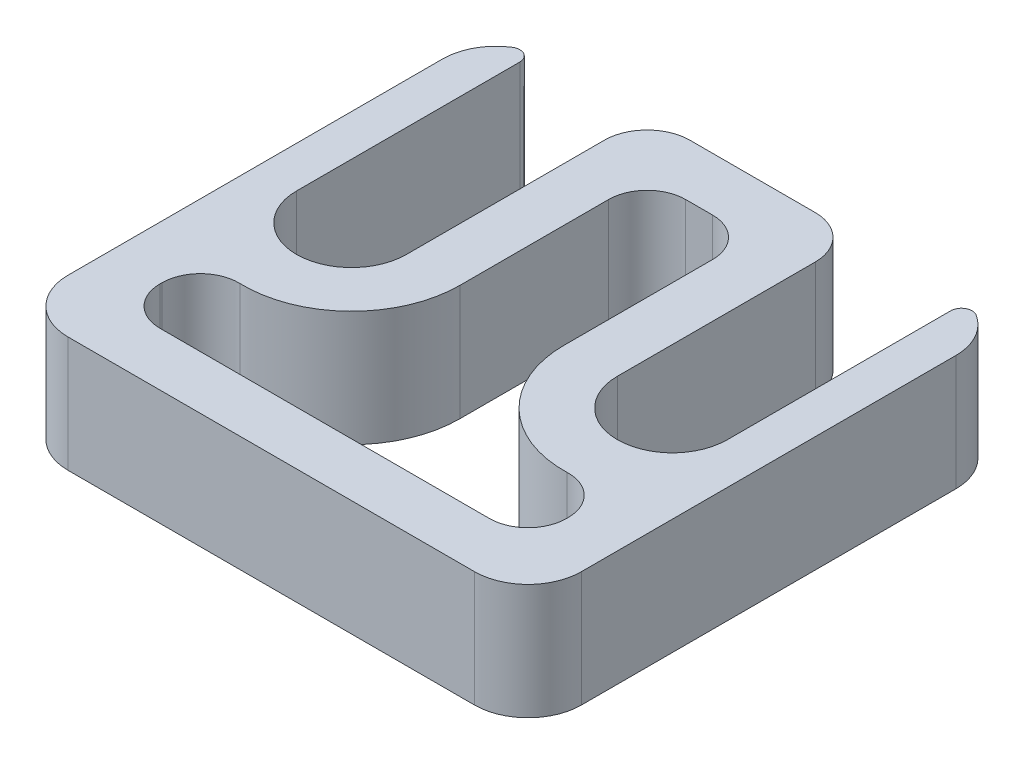
ISO-10303-21;
HEADER;
FILE_DESCRIPTION(('STEP AP214'),'2;1');
FILE_NAME('part.step','',(''),(''),'','','');
FILE_SCHEMA(('AUTOMOTIVE_DESIGN { 1 0 10303 214 1 1 1 1 }'));
ENDSEC;
DATA;
#1=APPLICATION_CONTEXT('core data for automotive mechanical design processes');
#2=APPLICATION_PROTOCOL_DEFINITION('international standard','automotive_design',2000,#1);
#3=PRODUCT_CONTEXT('',#1,'mechanical');
#4=PRODUCT('Part','Part','',(#3));
#5=PRODUCT_RELATED_PRODUCT_CATEGORY('part','',(#4));
#6=PRODUCT_DEFINITION_FORMATION('','',#4);
#7=PRODUCT_DEFINITION_CONTEXT('part definition',#1,'design');
#8=PRODUCT_DEFINITION('design','',#6,#7);
#9=PRODUCT_DEFINITION_SHAPE('','',#8);
#10=(LENGTH_UNIT() NAMED_UNIT(*) SI_UNIT(.MILLI.,.METRE.));
#11=(NAMED_UNIT(*) PLANE_ANGLE_UNIT() SI_UNIT($,.RADIAN.));
#12=(NAMED_UNIT(*) SI_UNIT($,.STERADIAN.) SOLID_ANGLE_UNIT());
#13=UNCERTAINTY_MEASURE_WITH_UNIT(LENGTH_MEASURE(1.E-05),#10,'distance_accuracy_value','');
#14=(GEOMETRIC_REPRESENTATION_CONTEXT(3) GLOBAL_UNCERTAINTY_ASSIGNED_CONTEXT((#13)) GLOBAL_UNIT_ASSIGNED_CONTEXT((#10,
#11,#12)) REPRESENTATION_CONTEXT('',''));
#15=CARTESIAN_POINT('',(0.,0.,0.));
#16=DIRECTION('',(0.,0.,1.));
#17=DIRECTION('',(1.,0.,0.));
#18=AXIS2_PLACEMENT_3D('',#15,#16,#17);
#19=CARTESIAN_POINT('',(3.17499999999999,552.958,280.4795));
#20=DIRECTION('',(0.,-1.,0.));
#21=DIRECTION('',(0.,0.,-1.));
#22=AXIS2_PLACEMENT_3D('',#19,#20,#21);
#23=PLANE('',#22);
#24=CARTESIAN_POINT('',(27.305,552.958,280.4795));
#25=DIRECTION('',(0.,-1.,0.));
#26=DIRECTION('',(0.,0.,-1.));
#27=AXIS2_PLACEMENT_3D('',#24,#25,#26);
#28=CIRCLE('',#27,3.17500000000001);
#29=CARTESIAN_POINT('',(29.003625,552.958,277.797094715675));
#30=VERTEX_POINT('',#29);
#31=CARTESIAN_POINT('',(30.48,552.958,280.4795));
#32=VERTEX_POINT('',#31);
#33=EDGE_CURVE('E307',#30,#32,#28,.T.);
#34=ORIENTED_EDGE('',*,*,#33,.F.);
#35=CARTESIAN_POINT('',(28.6639,552.958,278.33357577254));
#36=DIRECTION('',(0.,-1.,0.));
#37=DIRECTION('',(0.,0.,-1.));
#38=AXIS2_PLACEMENT_3D('',#35,#36,#37);
#39=CIRCLE('',#38,0.635);
#40=CARTESIAN_POINT('',(28.0289,552.958,278.33357577254));
#41=VERTEX_POINT('',#40);
#42=EDGE_CURVE('E413',#30,#41,#39,.F.);
#43=ORIENTED_EDGE('',*,*,#42,.T.);
#44=DIRECTION('',(0.,0.,-1.));
#45=VECTOR('',#44,1.);
#46=CARTESIAN_POINT('',(28.0289,552.958,291.592));
#47=LINE('',#46,#45);
#48=CARTESIAN_POINT('',(28.0289,552.958,291.592));
#49=VERTEX_POINT('',#48);
#50=EDGE_CURVE('E304',#49,#41,#47,.T.);
#51=ORIENTED_EDGE('',*,*,#50,.F.);
#52=CARTESIAN_POINT('',(24.765,552.958,291.592));
#53=DIRECTION('',(0.,1.,0.));
#54=DIRECTION('',(0.,0.,-1.));
#55=AXIS2_PLACEMENT_3D('',#52,#53,#54);
#56=CIRCLE('',#55,3.26389999999999);
#57=CARTESIAN_POINT('',(21.5011,552.958,291.592));
#58=VERTEX_POINT('',#57);
#59=EDGE_CURVE('E301',#58,#49,#56,.T.);
#60=ORIENTED_EDGE('',*,*,#59,.F.);
#61=DIRECTION('',(0.,0.,1.));
#62=VECTOR('',#61,1.);
#63=CARTESIAN_POINT('',(21.5011,552.958,291.592));
#64=LINE('',#63,#62);
#65=CARTESIAN_POINT('',(21.5011,552.958,279.8445));
#66=VERTEX_POINT('',#65);
#67=EDGE_CURVE('E299',#66,#58,#64,.T.);
#68=ORIENTED_EDGE('',*,*,#67,.F.);
#69=CARTESIAN_POINT('',(18.9611,552.958,279.8445));
#70=DIRECTION('',(0.,-1.,0.));
#71=DIRECTION('',(0.,0.,-1.));
#72=AXIS2_PLACEMENT_3D('',#69,#70,#71);
#73=CIRCLE('',#72,2.54);
#74=CARTESIAN_POINT('',(18.9611,552.958,277.3045));
#75=VERTEX_POINT('',#74);
#76=EDGE_CURVE('E397',#66,#75,#73,.F.);
#77=ORIENTED_EDGE('',*,*,#76,.T.);
#78=DIRECTION('',(1.,0.,0.));
#79=VECTOR('',#78,1.);
#80=CARTESIAN_POINT('',(8.97889999999997,552.958,277.3045));
#81=LINE('',#80,#79);
#82=CARTESIAN_POINT('',(11.5189,552.958,277.3045));
#83=VERTEX_POINT('',#82);
#84=EDGE_CURVE('E296',#83,#75,#81,.T.);
#85=ORIENTED_EDGE('',*,*,#84,.F.);
#86=CARTESIAN_POINT('',(11.5189,552.958,279.8445));
#87=DIRECTION('',(0.,-1.,0.));
#88=DIRECTION('',(0.,0.,-1.));
#89=AXIS2_PLACEMENT_3D('',#86,#87,#88);
#90=CIRCLE('',#89,2.54);
#91=CARTESIAN_POINT('',(8.97889999999997,552.958,279.8445));
#92=VERTEX_POINT('',#91);
#93=EDGE_CURVE('E395',#83,#92,#90,.F.);
#94=ORIENTED_EDGE('',*,*,#93,.T.);
#95=DIRECTION('',(0.,0.,-1.));
#96=VECTOR('',#95,1.);
#97=CARTESIAN_POINT('',(8.97889999999997,552.958,291.592));
#98=LINE('',#97,#96);
#99=CARTESIAN_POINT('',(8.97889999999997,552.958,291.592));
#100=VERTEX_POINT('',#99);
#101=EDGE_CURVE('E293',#100,#92,#98,.T.);
#102=ORIENTED_EDGE('',*,*,#101,.F.);
#103=CARTESIAN_POINT('',(5.71499999999998,552.958,291.592));
#104=DIRECTION('',(0.,1.,0.));
#105=DIRECTION('',(0.,0.,-1.));
#106=AXIS2_PLACEMENT_3D('',#103,#104,#105);
#107=CIRCLE('',#106,3.26389999999999);
#108=CARTESIAN_POINT('',(2.4511,552.958,291.592));
#109=VERTEX_POINT('',#108);
#110=EDGE_CURVE('E290',#109,#100,#107,.T.);
#111=ORIENTED_EDGE('',*,*,#110,.F.);
#112=DIRECTION('',(0.,0.,1.));
#113=VECTOR('',#112,1.);
#114=CARTESIAN_POINT('',(2.4511,552.958,291.592));
#115=LINE('',#114,#113);
#116=CARTESIAN_POINT('',(2.4511,552.958,278.33357577254));
#117=VERTEX_POINT('',#116);
#118=EDGE_CURVE('E287',#117,#109,#115,.T.);
#119=ORIENTED_EDGE('',*,*,#118,.F.);
#120=CARTESIAN_POINT('',(1.8161,552.958,278.33357577254));
#121=DIRECTION('',(0.,-1.,0.));
#122=DIRECTION('',(0.,0.,-1.));
#123=AXIS2_PLACEMENT_3D('',#120,#121,#122);
#124=CIRCLE('',#123,0.635);
#125=CARTESIAN_POINT('',(1.47637500000001,552.958,277.797094715675));
#126=VERTEX_POINT('',#125);
#127=EDGE_CURVE('E411',#117,#126,#124,.F.);
#128=ORIENTED_EDGE('',*,*,#127,.T.);
#129=CARTESIAN_POINT('',(3.17499999999999,552.958,280.4795));
#130=DIRECTION('',(0.,-1.,0.));
#131=DIRECTION('',(0.,0.,-1.));
#132=AXIS2_PLACEMENT_3D('',#129,#130,#131);
#133=CIRCLE('',#132,3.17499999999999);
#134=CARTESIAN_POINT('',(0.,552.958,280.4795));
#135=VERTEX_POINT('',#134);
#136=EDGE_CURVE('E284',#135,#126,#133,.T.);
#137=ORIENTED_EDGE('',*,*,#136,.F.);
#138=DIRECTION('',(0.,0.,-1.));
#139=VECTOR('',#138,1.);
#140=CARTESIAN_POINT('',(0.,552.958,302.7045));
#141=LINE('',#140,#139);
#142=CARTESIAN_POINT('',(0.,552.958,302.7045));
#143=VERTEX_POINT('',#142);
#144=EDGE_CURVE('E321',#143,#135,#141,.T.);
#145=ORIENTED_EDGE('',*,*,#144,.F.);
#146=CARTESIAN_POINT('',(3.17499999999999,552.958,302.7045));
#147=DIRECTION('',(0.,-1.,0.));
#148=DIRECTION('',(0.,0.,-1.));
#149=AXIS2_PLACEMENT_3D('',#146,#147,#148);
#150=CIRCLE('',#149,3.17499999999998);
#151=CARTESIAN_POINT('',(3.17499999999999,552.958,305.8795));
#152=VERTEX_POINT('',#151);
#153=EDGE_CURVE('E318',#152,#143,#150,.T.);
#154=ORIENTED_EDGE('',*,*,#153,.F.);
#155=DIRECTION('',(-1.,0.,0.));
#156=VECTOR('',#155,1.);
#157=CARTESIAN_POINT('',(27.305,552.958,305.8795));
#158=LINE('',#157,#156);
#159=CARTESIAN_POINT('',(27.305,552.958,305.8795));
#160=VERTEX_POINT('',#159);
#161=EDGE_CURVE('E315',#160,#152,#158,.T.);
#162=ORIENTED_EDGE('',*,*,#161,.F.);
#163=CARTESIAN_POINT('',(27.305,552.958,302.7045));
#164=DIRECTION('',(0.,-1.,0.));
#165=DIRECTION('',(0.,0.,-1.));
#166=AXIS2_PLACEMENT_3D('',#163,#164,#165);
#167=CIRCLE('',#166,3.17499999999998);
#168=CARTESIAN_POINT('',(30.48,552.958,302.7045));
#169=VERTEX_POINT('',#168);
#170=EDGE_CURVE('E312',#169,#160,#167,.T.);
#171=ORIENTED_EDGE('',*,*,#170,.F.);
#172=DIRECTION('',(0.,0.,1.));
#173=VECTOR('',#172,1.);
#174=CARTESIAN_POINT('',(30.48,552.958,280.4795));
#175=LINE('',#174,#173);
#176=EDGE_CURVE('E309',#32,#169,#175,.T.);
#177=ORIENTED_EDGE('',*,*,#176,.F.);
#178=EDGE_LOOP('',(#34,#43,#51,#60,#68,#77,#85,#94,#102,#111,#119,#128,#137,#145,#154,#162,#171,#177));
#179=FACE_BOUND('',#178,.T.);
#180=CARTESIAN_POINT('',(24.765,552.958,291.592));
#181=DIRECTION('',(0.,-1.,0.));
#182=DIRECTION('',(0.,0.,-1.));
#183=AXIS2_PLACEMENT_3D('',#180,#181,#182);
#184=CIRCLE('',#183,6.4389);
#185=CARTESIAN_POINT('',(24.9524497816594,552.958,298.028170894978));
#186=VERTEX_POINT('',#185);
#187=CARTESIAN_POINT('',(18.3261,552.958,291.592));
#188=VERTEX_POINT('',#187);
#189=EDGE_CURVE('E617',#186,#188,#184,.T.);
#190=ORIENTED_EDGE('',*,*,#189,.F.);
#191=CARTESIAN_POINT('',(25.019,552.958,300.313201981952));
#192=DIRECTION('',(0.,-1.,0.));
#193=DIRECTION('',(0.,0.,-1.));
#194=AXIS2_PLACEMENT_3D('',#191,#192,#193);
#195=CIRCLE('',#194,2.286);
#196=CARTESIAN_POINT('',(27.305,552.958,300.313201981952));
#197=VERTEX_POINT('',#196);
#198=EDGE_CURVE('E474',#186,#197,#195,.T.);
#199=ORIENTED_EDGE('',*,*,#198,.T.);
#200=DIRECTION('',(0.,0.,1.));
#201=VECTOR('',#200,1.);
#202=CARTESIAN_POINT('',(27.305,552.958,0.));
#203=LINE('',#202,#201);
#204=CARTESIAN_POINT('',(27.305,552.958,300.4185));
#205=VERTEX_POINT('',#204);
#206=EDGE_CURVE('E612',#197,#205,#203,.T.);
#207=ORIENTED_EDGE('',*,*,#206,.T.);
#208=CARTESIAN_POINT('',(25.019,552.958,300.4185));
#209=DIRECTION('',(0.,-1.,0.));
#210=DIRECTION('',(0.,0.,-1.));
#211=AXIS2_PLACEMENT_3D('',#208,#209,#210);
#212=CIRCLE('',#211,2.286);
#213=CARTESIAN_POINT('',(25.019,552.958,302.7045));
#214=VERTEX_POINT('',#213);
#215=EDGE_CURVE('E478',#205,#214,#212,.T.);
#216=ORIENTED_EDGE('',*,*,#215,.T.);
#217=DIRECTION('',(-1.,0.,0.));
#218=VECTOR('',#217,1.);
#219=CARTESIAN_POINT('',(0.,552.958,302.7045));
#220=LINE('',#219,#218);
#221=CARTESIAN_POINT('',(5.46099999999999,552.958,302.7045));
#222=VERTEX_POINT('',#221);
#223=EDGE_CURVE('E273',#214,#222,#220,.T.);
#224=ORIENTED_EDGE('',*,*,#223,.T.);
#225=CARTESIAN_POINT('',(5.46099999999999,552.958,300.4185));
#226=DIRECTION('',(0.,-1.,0.));
#227=DIRECTION('',(0.,0.,-1.));
#228=AXIS2_PLACEMENT_3D('',#225,#226,#227);
#229=CIRCLE('',#228,2.286);
#230=CARTESIAN_POINT('',(3.17499999999999,552.958,300.4185));
#231=VERTEX_POINT('',#230);
#232=EDGE_CURVE('E482',#222,#231,#229,.T.);
#233=ORIENTED_EDGE('',*,*,#232,.T.);
#234=DIRECTION('',(0.,0.,-1.));
#235=VECTOR('',#234,1.);
#236=CARTESIAN_POINT('',(3.17499999999999,552.958,0.));
#237=LINE('',#236,#235);
#238=CARTESIAN_POINT('',(3.17499999999999,552.958,300.313201981952));
#239=VERTEX_POINT('',#238);
#240=EDGE_CURVE('E271',#231,#239,#237,.T.);
#241=ORIENTED_EDGE('',*,*,#240,.T.);
#242=CARTESIAN_POINT('',(5.46099999999999,552.958,300.313201981952));
#243=DIRECTION('',(0.,-1.,0.));
#244=DIRECTION('',(0.,0.,-1.));
#245=AXIS2_PLACEMENT_3D('',#242,#243,#244);
#246=CIRCLE('',#245,2.286);
#247=CARTESIAN_POINT('',(5.5275502183406,552.958,298.028170894978));
#248=VERTEX_POINT('',#247);
#249=EDGE_CURVE('E270',#239,#248,#246,.T.);
#250=ORIENTED_EDGE('',*,*,#249,.T.);
#251=CARTESIAN_POINT('',(5.71499999999998,552.958,291.592));
#252=DIRECTION('',(0.,-1.,0.));
#253=DIRECTION('',(0.,0.,-1.));
#254=AXIS2_PLACEMENT_3D('',#251,#252,#253);
#255=CIRCLE('',#254,6.4389);
#256=CARTESIAN_POINT('',(12.1539,552.958,291.592));
#257=VERTEX_POINT('',#256);
#258=EDGE_CURVE('E254',#257,#248,#255,.T.);
#259=ORIENTED_EDGE('',*,*,#258,.F.);
#260=DIRECTION('',(0.,0.,-1.));
#261=VECTOR('',#260,1.);
#262=CARTESIAN_POINT('',(12.1539,552.958,0.));
#263=LINE('',#262,#261);
#264=CARTESIAN_POINT('',(12.1539,552.958,282.7655));
#265=VERTEX_POINT('',#264);
#266=EDGE_CURVE('E261',#257,#265,#263,.T.);
#267=ORIENTED_EDGE('',*,*,#266,.T.);
#268=CARTESIAN_POINT('',(14.4399,552.958,282.7655));
#269=DIRECTION('',(0.,-1.,0.));
#270=DIRECTION('',(0.,0.,-1.));
#271=AXIS2_PLACEMENT_3D('',#268,#269,#270);
#272=CIRCLE('',#271,2.286);
#273=CARTESIAN_POINT('',(14.4399,552.958,280.4795));
#274=VERTEX_POINT('',#273);
#275=EDGE_CURVE('E11',#265,#274,#272,.T.);
#276=ORIENTED_EDGE('',*,*,#275,.T.);
#277=DIRECTION('',(1.,0.,0.));
#278=VECTOR('',#277,1.);
#279=CARTESIAN_POINT('',(0.,552.958,280.4795));
#280=LINE('',#279,#278);
#281=CARTESIAN_POINT('',(16.0401,552.958,280.4795));
#282=VERTEX_POINT('',#281);
#283=EDGE_CURVE('E265',#274,#282,#280,.T.);
#284=ORIENTED_EDGE('',*,*,#283,.T.);
#285=CARTESIAN_POINT('',(16.0401,552.958,282.7655));
#286=DIRECTION('',(0.,-1.,0.));
#287=DIRECTION('',(0.,0.,-1.));
#288=AXIS2_PLACEMENT_3D('',#285,#286,#287);
#289=CIRCLE('',#288,2.286);
#290=CARTESIAN_POINT('',(18.3261,552.958,282.7655));
#291=VERTEX_POINT('',#290);
#292=EDGE_CURVE('E470',#282,#291,#289,.T.);
#293=ORIENTED_EDGE('',*,*,#292,.T.);
#294=DIRECTION('',(0.,0.,1.));
#295=VECTOR('',#294,1.);
#296=CARTESIAN_POINT('',(18.3261,552.958,0.));
#297=LINE('',#296,#295);
#298=EDGE_CURVE('E259',#291,#188,#297,.T.);
#299=ORIENTED_EDGE('',*,*,#298,.T.);
#300=EDGE_LOOP('',(#190,#199,#207,#216,#224,#233,#241,#250,#259,#267,#276,#284,#293,#299));
#301=FACE_BOUND('',#300,.T.);
#302=ADVANCED_FACE('F41',(#179,#301),#23,.F.);
#303=CARTESIAN_POINT('',(3.17499999999999,546.1,280.4795));
#304=DIRECTION('',(0.,-1.,0.));
#305=DIRECTION('',(0.,0.,-1.));
#306=AXIS2_PLACEMENT_3D('',#303,#304,#305);
#307=PLANE('',#306);
#308=DIRECTION('',(0.,0.,-1.));
#309=VECTOR('',#308,1.);
#310=CARTESIAN_POINT('',(28.0289,546.1,291.592));
#311=LINE('',#310,#309);
#312=CARTESIAN_POINT('',(28.0289,546.1,291.592));
#313=VERTEX_POINT('',#312);
#314=CARTESIAN_POINT('',(28.0289,546.1,278.33357577254));
#315=VERTEX_POINT('',#314);
#316=EDGE_CURVE('E343',#313,#315,#311,.T.);
#317=ORIENTED_EDGE('',*,*,#316,.T.);
#318=CARTESIAN_POINT('',(28.6639,546.1,278.33357577254));
#319=DIRECTION('',(0.,-1.,0.));
#320=DIRECTION('',(0.,0.,-1.));
#321=AXIS2_PLACEMENT_3D('',#318,#319,#320);
#322=CIRCLE('',#321,0.635);
#323=CARTESIAN_POINT('',(29.003625,546.1,277.797094715675));
#324=VERTEX_POINT('',#323);
#325=EDGE_CURVE('E407',#315,#324,#322,.T.);
#326=ORIENTED_EDGE('',*,*,#325,.T.);
#327=CARTESIAN_POINT('',(27.305,546.1,280.4795));
#328=DIRECTION('',(0.,-1.,0.));
#329=DIRECTION('',(0.,0.,-1.));
#330=AXIS2_PLACEMENT_3D('',#327,#328,#329);
#331=CIRCLE('',#330,3.17500000000001);
#332=CARTESIAN_POINT('',(30.48,546.1,280.4795));
#333=VERTEX_POINT('',#332);
#334=EDGE_CURVE('E346',#324,#333,#331,.T.);
#335=ORIENTED_EDGE('',*,*,#334,.T.);
#336=DIRECTION('',(0.,0.,1.));
#337=VECTOR('',#336,1.);
#338=CARTESIAN_POINT('',(30.48,546.1,280.4795));
#339=LINE('',#338,#337);
#340=CARTESIAN_POINT('',(30.48,546.1,302.7045));
#341=VERTEX_POINT('',#340);
#342=EDGE_CURVE('E348',#333,#341,#339,.T.);
#343=ORIENTED_EDGE('',*,*,#342,.T.);
#344=CARTESIAN_POINT('',(27.305,546.1,302.7045));
#345=DIRECTION('',(0.,-1.,0.));
#346=DIRECTION('',(0.,0.,-1.));
#347=AXIS2_PLACEMENT_3D('',#344,#345,#346);
#348=CIRCLE('',#347,3.17499999999998);
#349=CARTESIAN_POINT('',(27.305,546.1,305.8795));
#350=VERTEX_POINT('',#349);
#351=EDGE_CURVE('E351',#341,#350,#348,.T.);
#352=ORIENTED_EDGE('',*,*,#351,.T.);
#353=DIRECTION('',(-1.,0.,0.));
#354=VECTOR('',#353,1.);
#355=CARTESIAN_POINT('',(27.305,546.1,305.8795));
#356=LINE('',#355,#354);
#357=CARTESIAN_POINT('',(3.17499999999999,546.1,305.8795));
#358=VERTEX_POINT('',#357);
#359=EDGE_CURVE('E354',#350,#358,#356,.T.);
#360=ORIENTED_EDGE('',*,*,#359,.T.);
#361=CARTESIAN_POINT('',(3.17499999999999,546.1,302.7045));
#362=DIRECTION('',(0.,-1.,0.));
#363=DIRECTION('',(0.,0.,-1.));
#364=AXIS2_PLACEMENT_3D('',#361,#362,#363);
#365=CIRCLE('',#364,3.17499999999998);
#366=CARTESIAN_POINT('',(0.,546.1,302.7045));
#367=VERTEX_POINT('',#366);
#368=EDGE_CURVE('E357',#358,#367,#365,.T.);
#369=ORIENTED_EDGE('',*,*,#368,.T.);
#370=DIRECTION('',(0.,0.,-1.));
#371=VECTOR('',#370,1.);
#372=CARTESIAN_POINT('',(0.,546.1,302.7045));
#373=LINE('',#372,#371);
#374=CARTESIAN_POINT('',(0.,546.1,280.4795));
#375=VERTEX_POINT('',#374);
#376=EDGE_CURVE('E288',#367,#375,#373,.T.);
#377=ORIENTED_EDGE('',*,*,#376,.T.);
#378=CARTESIAN_POINT('',(3.17499999999999,546.1,280.4795));
#379=DIRECTION('',(0.,-1.,0.));
#380=DIRECTION('',(0.,0.,-1.));
#381=AXIS2_PLACEMENT_3D('',#378,#379,#380);
#382=CIRCLE('',#381,3.17499999999999);
#383=CARTESIAN_POINT('',(1.47637500000001,546.1,277.797094715675));
#384=VERTEX_POINT('',#383);
#385=EDGE_CURVE('E282',#375,#384,#382,.T.);
#386=ORIENTED_EDGE('',*,*,#385,.T.);
#387=CARTESIAN_POINT('',(1.8161,546.1,278.33357577254));
#388=DIRECTION('',(0.,-1.,0.));
#389=DIRECTION('',(0.,0.,-1.));
#390=AXIS2_PLACEMENT_3D('',#387,#388,#389);
#391=CIRCLE('',#390,0.635);
#392=CARTESIAN_POINT('',(2.4511,546.1,278.33357577254));
#393=VERTEX_POINT('',#392);
#394=EDGE_CURVE('E405',#384,#393,#391,.T.);
#395=ORIENTED_EDGE('',*,*,#394,.T.);
#396=DIRECTION('',(0.,0.,1.));
#397=VECTOR('',#396,1.);
#398=CARTESIAN_POINT('',(2.4511,546.1,291.592));
#399=LINE('',#398,#397);
#400=CARTESIAN_POINT('',(2.4511,546.1,291.592));
#401=VERTEX_POINT('',#400);
#402=EDGE_CURVE('E327',#393,#401,#399,.T.);
#403=ORIENTED_EDGE('',*,*,#402,.T.);
#404=CARTESIAN_POINT('',(5.71499999999998,546.1,291.592));
#405=DIRECTION('',(0.,1.,0.));
#406=DIRECTION('',(0.,0.,-1.));
#407=AXIS2_PLACEMENT_3D('',#404,#405,#406);
#408=CIRCLE('',#407,3.26389999999999);
#409=CARTESIAN_POINT('',(8.97889999999997,546.1,291.592));
#410=VERTEX_POINT('',#409);
#411=EDGE_CURVE('E329',#401,#410,#408,.T.);
#412=ORIENTED_EDGE('',*,*,#411,.T.);
#413=DIRECTION('',(0.,0.,-1.));
#414=VECTOR('',#413,1.);
#415=CARTESIAN_POINT('',(8.97889999999997,546.1,291.592));
#416=LINE('',#415,#414);
#417=CARTESIAN_POINT('',(8.97889999999997,546.1,279.8445));
#418=VERTEX_POINT('',#417);
#419=EDGE_CURVE('E332',#410,#418,#416,.T.);
#420=ORIENTED_EDGE('',*,*,#419,.T.);
#421=CARTESIAN_POINT('',(11.5189,546.1,279.8445));
#422=DIRECTION('',(0.,-1.,0.));
#423=DIRECTION('',(0.,0.,-1.));
#424=AXIS2_PLACEMENT_3D('',#421,#422,#423);
#425=CIRCLE('',#424,2.54);
#426=CARTESIAN_POINT('',(11.5189,546.1,277.3045));
#427=VERTEX_POINT('',#426);
#428=EDGE_CURVE('E389',#418,#427,#425,.T.);
#429=ORIENTED_EDGE('',*,*,#428,.T.);
#430=DIRECTION('',(1.,0.,0.));
#431=VECTOR('',#430,1.);
#432=CARTESIAN_POINT('',(8.97889999999997,546.1,277.3045));
#433=LINE('',#432,#431);
#434=CARTESIAN_POINT('',(18.9611,546.1,277.3045));
#435=VERTEX_POINT('',#434);
#436=EDGE_CURVE('E335',#427,#435,#433,.T.);
#437=ORIENTED_EDGE('',*,*,#436,.T.);
#438=CARTESIAN_POINT('',(18.9611,546.1,279.8445));
#439=DIRECTION('',(0.,-1.,0.));
#440=DIRECTION('',(0.,0.,-1.));
#441=AXIS2_PLACEMENT_3D('',#438,#439,#440);
#442=CIRCLE('',#441,2.54);
#443=CARTESIAN_POINT('',(21.5011,546.1,279.8445));
#444=VERTEX_POINT('',#443);
#445=EDGE_CURVE('E391',#435,#444,#442,.T.);
#446=ORIENTED_EDGE('',*,*,#445,.T.);
#447=DIRECTION('',(0.,0.,1.));
#448=VECTOR('',#447,1.);
#449=CARTESIAN_POINT('',(21.5011,546.1,291.592));
#450=LINE('',#449,#448);
#451=CARTESIAN_POINT('',(21.5011,546.1,291.592));
#452=VERTEX_POINT('',#451);
#453=EDGE_CURVE('E338',#444,#452,#450,.T.);
#454=ORIENTED_EDGE('',*,*,#453,.T.);
#455=CARTESIAN_POINT('',(24.765,546.1,291.592));
#456=DIRECTION('',(0.,1.,0.));
#457=DIRECTION('',(0.,0.,-1.));
#458=AXIS2_PLACEMENT_3D('',#455,#456,#457);
#459=CIRCLE('',#458,3.26389999999999);
#460=EDGE_CURVE('E340',#452,#313,#459,.T.);
#461=ORIENTED_EDGE('',*,*,#460,.T.);
#462=EDGE_LOOP('',(#317,#326,#335,#343,#352,#360,#369,#377,#386,#395,#403,#412,#420,#429,#437,
#446,#454,#461));
#463=FACE_BOUND('',#462,.T.);
#464=DIRECTION('',(0.,0.,1.));
#465=VECTOR('',#464,1.);
#466=CARTESIAN_POINT('',(27.305,546.1,280.4795));
#467=LINE('',#466,#465);
#468=CARTESIAN_POINT('',(27.305,546.1,300.313201981952));
#469=VERTEX_POINT('',#468);
#470=CARTESIAN_POINT('',(27.305,546.1,300.4185));
#471=VERTEX_POINT('',#470);
#472=EDGE_CURVE('E420',#469,#471,#467,.T.);
#473=ORIENTED_EDGE('',*,*,#472,.F.);
#474=CARTESIAN_POINT('',(25.019,546.1,300.313201981952));
#475=DIRECTION('',(0.,-1.,0.));
#476=DIRECTION('',(0.,0.,-1.));
#477=AXIS2_PLACEMENT_3D('',#474,#475,#476);
#478=CIRCLE('',#477,2.286);
#479=CARTESIAN_POINT('',(24.9524497816594,546.1,298.028170894978));
#480=VERTEX_POINT('',#479);
#481=EDGE_CURVE('E472',#469,#480,#478,.F.);
#482=ORIENTED_EDGE('',*,*,#481,.T.);
#483=CARTESIAN_POINT('',(24.765,546.1,291.592));
#484=DIRECTION('',(0.,-1.,0.));
#485=DIRECTION('',(1.,0.,0.));
#486=AXIS2_PLACEMENT_3D('',#483,#484,#485);
#487=CIRCLE('',#486,6.4389);
#488=CARTESIAN_POINT('',(18.3261,546.1,291.592));
#489=VERTEX_POINT('',#488);
#490=EDGE_CURVE('E437',#480,#489,#487,.T.);
#491=ORIENTED_EDGE('',*,*,#490,.T.);
#492=DIRECTION('',(0.,0.,1.));
#493=VECTOR('',#492,1.);
#494=CARTESIAN_POINT('',(18.3261,546.1,280.4795));
#495=LINE('',#494,#493);
#496=CARTESIAN_POINT('',(18.3261,546.1,282.7655));
#497=VERTEX_POINT('',#496);
#498=EDGE_CURVE('E434',#497,#489,#495,.T.);
#499=ORIENTED_EDGE('',*,*,#498,.F.);
#500=CARTESIAN_POINT('',(16.0401,546.1,282.7655));
#501=DIRECTION('',(0.,-1.,0.));
#502=DIRECTION('',(0.,0.,-1.));
#503=AXIS2_PLACEMENT_3D('',#500,#501,#502);
#504=CIRCLE('',#503,2.286);
#505=CARTESIAN_POINT('',(16.0401,546.1,280.4795));
#506=VERTEX_POINT('',#505);
#507=EDGE_CURVE('E468',#497,#506,#504,.F.);
#508=ORIENTED_EDGE('',*,*,#507,.T.);
#509=DIRECTION('',(1.,0.,0.));
#510=VECTOR('',#509,1.);
#511=CARTESIAN_POINT('',(3.17499999999999,546.1,280.4795));
#512=LINE('',#511,#510);
#513=CARTESIAN_POINT('',(14.4399,546.1,280.4795));
#514=VERTEX_POINT('',#513);
#515=EDGE_CURVE('E431',#514,#506,#512,.T.);
#516=ORIENTED_EDGE('',*,*,#515,.F.);
#517=CARTESIAN_POINT('',(14.4399,546.1,282.7655));
#518=DIRECTION('',(0.,-1.,0.));
#519=DIRECTION('',(0.,0.,-1.));
#520=AXIS2_PLACEMENT_3D('',#517,#518,#519);
#521=CIRCLE('',#520,2.286);
#522=CARTESIAN_POINT('',(12.1539,546.1,282.7655));
#523=VERTEX_POINT('',#522);
#524=EDGE_CURVE('E49',#514,#523,#521,.F.);
#525=ORIENTED_EDGE('',*,*,#524,.T.);
#526=DIRECTION('',(0.,0.,-1.));
#527=VECTOR('',#526,1.);
#528=CARTESIAN_POINT('',(12.1539,546.1,280.4795));
#529=LINE('',#528,#527);
#530=CARTESIAN_POINT('',(12.1539,546.1,291.592));
#531=VERTEX_POINT('',#530);
#532=EDGE_CURVE('E429',#531,#523,#529,.T.);
#533=ORIENTED_EDGE('',*,*,#532,.F.);
#534=CARTESIAN_POINT('',(5.71499999999998,546.1,291.592));
#535=DIRECTION('',(0.,-1.,0.));
#536=DIRECTION('',(1.,0.,0.));
#537=AXIS2_PLACEMENT_3D('',#534,#535,#536);
#538=CIRCLE('',#537,6.4389);
#539=CARTESIAN_POINT('',(5.5275502183406,546.1,298.028170894978));
#540=VERTEX_POINT('',#539);
#541=EDGE_CURVE('E257',#531,#540,#538,.T.);
#542=ORIENTED_EDGE('',*,*,#541,.T.);
#543=CARTESIAN_POINT('',(5.46099999999999,546.1,300.313201981952));
#544=DIRECTION('',(0.,-1.,0.));
#545=DIRECTION('',(0.,0.,-1.));
#546=AXIS2_PLACEMENT_3D('',#543,#544,#545);
#547=CIRCLE('',#546,2.286);
#548=CARTESIAN_POINT('',(3.17499999999999,546.1,300.313201981952));
#549=VERTEX_POINT('',#548);
#550=EDGE_CURVE('E484',#540,#549,#547,.F.);
#551=ORIENTED_EDGE('',*,*,#550,.T.);
#552=DIRECTION('',(0.,0.,-1.));
#553=VECTOR('',#552,1.);
#554=CARTESIAN_POINT('',(3.17499999999999,546.1,280.4795));
#555=LINE('',#554,#553);
#556=CARTESIAN_POINT('',(3.17499999999999,546.1,300.4185));
#557=VERTEX_POINT('',#556);
#558=EDGE_CURVE('E426',#557,#549,#555,.T.);
#559=ORIENTED_EDGE('',*,*,#558,.F.);
#560=CARTESIAN_POINT('',(5.46099999999999,546.1,300.4185));
#561=DIRECTION('',(0.,-1.,0.));
#562=DIRECTION('',(0.,0.,-1.));
#563=AXIS2_PLACEMENT_3D('',#560,#561,#562);
#564=CIRCLE('',#563,2.286);
#565=CARTESIAN_POINT('',(5.46099999999999,546.1,302.7045));
#566=VERTEX_POINT('',#565);
#567=EDGE_CURVE('E480',#557,#566,#564,.F.);
#568=ORIENTED_EDGE('',*,*,#567,.T.);
#569=DIRECTION('',(-1.,0.,0.));
#570=VECTOR('',#569,1.);
#571=CARTESIAN_POINT('',(3.17499999999999,546.1,302.7045));
#572=LINE('',#571,#570);
#573=CARTESIAN_POINT('',(25.019,546.1,302.7045));
#574=VERTEX_POINT('',#573);
#575=EDGE_CURVE('E423',#574,#566,#572,.T.);
#576=ORIENTED_EDGE('',*,*,#575,.F.);
#577=CARTESIAN_POINT('',(25.019,546.1,300.4185));
#578=DIRECTION('',(0.,-1.,0.));
#579=DIRECTION('',(0.,0.,-1.));
#580=AXIS2_PLACEMENT_3D('',#577,#578,#579);
#581=CIRCLE('',#580,2.286);
#582=EDGE_CURVE('E476',#574,#471,#581,.F.);
#583=ORIENTED_EDGE('',*,*,#582,.T.);
#584=EDGE_LOOP('',(#473,#482,#491,#499,#508,#516,#525,#533,#542,#551,#559,#568,#576,#583));
#585=FACE_BOUND('',#584,.T.);
#586=ADVANCED_FACE('F488',(#463,#585),#307,.T.);
#587=CARTESIAN_POINT('',(3.17499999999999,552.958,280.4795));
#588=DIRECTION('',(0.,-1.,0.));
#589=DIRECTION('',(0.,0.,-1.));
#590=AXIS2_PLACEMENT_3D('',#587,#588,#589);
#591=CYLINDRICAL_SURFACE('',#590,3.17499999999999);
#592=ORIENTED_EDGE('',*,*,#136,.T.);
#593=DIRECTION('',(0.,-1.,0.));
#594=VECTOR('',#593,1.);
#595=CARTESIAN_POINT('',(1.476375,552.958,277.797094715675));
#596=LINE('',#595,#594);
#597=EDGE_CURVE('E415',#126,#384,#596,.T.);
#598=ORIENTED_EDGE('',*,*,#597,.T.);
#599=ORIENTED_EDGE('',*,*,#385,.F.);
#600=DIRECTION('',(0.,-1.,0.));
#601=VECTOR('',#600,1.);
#602=CARTESIAN_POINT('',(0.,552.958,280.4795));
#603=LINE('',#602,#601);
#604=EDGE_CURVE('E362',#135,#375,#603,.T.);
#605=ORIENTED_EDGE('',*,*,#604,.F.);
#606=EDGE_LOOP('',(#592,#598,#599,#605));
#607=FACE_BOUND('',#606,.T.);
#608=ADVANCED_FACE('F512',(#607),#591,.T.);
#609=CARTESIAN_POINT('',(0.,552.958,302.7045));
#610=DIRECTION('',(-1.,0.,0.));
#611=DIRECTION('',(0.,0.,1.));
#612=AXIS2_PLACEMENT_3D('',#609,#610,#611);
#613=PLANE('',#612);
#614=ORIENTED_EDGE('',*,*,#376,.F.);
#615=DIRECTION('',(0.,-1.,0.));
#616=VECTOR('',#615,1.);
#617=CARTESIAN_POINT('',(0.,552.958,302.7045));
#618=LINE('',#617,#616);
#619=EDGE_CURVE('E365',#143,#367,#618,.T.);
#620=ORIENTED_EDGE('',*,*,#619,.F.);
#621=ORIENTED_EDGE('',*,*,#144,.T.);
#622=ORIENTED_EDGE('',*,*,#604,.T.);
#623=EDGE_LOOP('',(#614,#620,#621,#622));
#624=FACE_BOUND('',#623,.T.);
#625=ADVANCED_FACE('F520',(#624),#613,.T.);
#626=CARTESIAN_POINT('',(3.17499999999999,552.958,302.7045));
#627=DIRECTION('',(0.,-1.,0.));
#628=DIRECTION('',(0.,0.,-1.));
#629=AXIS2_PLACEMENT_3D('',#626,#627,#628);
#630=CYLINDRICAL_SURFACE('',#629,3.17499999999998);
#631=ORIENTED_EDGE('',*,*,#368,.F.);
#632=DIRECTION('',(0.,-1.,0.));
#633=VECTOR('',#632,1.);
#634=CARTESIAN_POINT('',(3.17499999999999,552.958,305.8795));
#635=LINE('',#634,#633);
#636=EDGE_CURVE('E367',#152,#358,#635,.T.);
#637=ORIENTED_EDGE('',*,*,#636,.F.);
#638=ORIENTED_EDGE('',*,*,#153,.T.);
#639=ORIENTED_EDGE('',*,*,#619,.T.);
#640=EDGE_LOOP('',(#631,#637,#638,#639));
#641=FACE_BOUND('',#640,.T.);
#642=ADVANCED_FACE('F523',(#641),#630,.T.);
#643=CARTESIAN_POINT('',(27.305,552.958,305.8795));
#644=DIRECTION('',(0.,0.,1.));
#645=DIRECTION('',(1.,0.,0.));
#646=AXIS2_PLACEMENT_3D('',#643,#644,#645);
#647=PLANE('',#646);
#648=ORIENTED_EDGE('',*,*,#359,.F.);
#649=DIRECTION('',(0.,-1.,0.));
#650=VECTOR('',#649,1.);
#651=CARTESIAN_POINT('',(27.305,552.958,305.8795));
#652=LINE('',#651,#650);
#653=EDGE_CURVE('E369',#160,#350,#652,.T.);
#654=ORIENTED_EDGE('',*,*,#653,.F.);
#655=ORIENTED_EDGE('',*,*,#161,.T.);
#656=ORIENTED_EDGE('',*,*,#636,.T.);
#657=EDGE_LOOP('',(#648,#654,#655,#656));
#658=FACE_BOUND('',#657,.T.);
#659=ADVANCED_FACE('F527',(#658),#647,.T.);
#660=CARTESIAN_POINT('',(27.305,552.958,302.7045));
#661=DIRECTION('',(0.,-1.,0.));
#662=DIRECTION('',(0.,0.,-1.));
#663=AXIS2_PLACEMENT_3D('',#660,#661,#662);
#664=CYLINDRICAL_SURFACE('',#663,3.17499999999998);
#665=ORIENTED_EDGE('',*,*,#351,.F.);
#666=DIRECTION('',(0.,-1.,0.));
#667=VECTOR('',#666,1.);
#668=CARTESIAN_POINT('',(30.48,552.958,302.7045));
#669=LINE('',#668,#667);
#670=EDGE_CURVE('E371',#169,#341,#669,.T.);
#671=ORIENTED_EDGE('',*,*,#670,.F.);
#672=ORIENTED_EDGE('',*,*,#170,.T.);
#673=ORIENTED_EDGE('',*,*,#653,.T.);
#674=EDGE_LOOP('',(#665,#671,#672,#673));
#675=FACE_BOUND('',#674,.T.);
#676=ADVANCED_FACE('F531',(#675),#664,.T.);
#677=CARTESIAN_POINT('',(30.48,552.958,280.4795));
#678=DIRECTION('',(1.,0.,0.));
#679=DIRECTION('',(0.,0.,-1.));
#680=AXIS2_PLACEMENT_3D('',#677,#678,#679);
#681=PLANE('',#680);
#682=ORIENTED_EDGE('',*,*,#342,.F.);
#683=DIRECTION('',(0.,-1.,0.));
#684=VECTOR('',#683,1.);
#685=CARTESIAN_POINT('',(30.48,552.958,280.4795));
#686=LINE('',#685,#684);
#687=EDGE_CURVE('E373',#32,#333,#686,.T.);
#688=ORIENTED_EDGE('',*,*,#687,.F.);
#689=ORIENTED_EDGE('',*,*,#176,.T.);
#690=ORIENTED_EDGE('',*,*,#670,.T.);
#691=EDGE_LOOP('',(#682,#688,#689,#690));
#692=FACE_BOUND('',#691,.T.);
#693=ADVANCED_FACE('F535',(#692),#681,.T.);
#694=CARTESIAN_POINT('',(27.305,552.958,280.4795));
#695=DIRECTION('',(0.,-1.,0.));
#696=DIRECTION('',(0.,0.,-1.));
#697=AXIS2_PLACEMENT_3D('',#694,#695,#696);
#698=CYLINDRICAL_SURFACE('',#697,3.17500000000001);
#699=ORIENTED_EDGE('',*,*,#334,.F.);
#700=DIRECTION('',(0.,-1.,0.));
#701=VECTOR('',#700,1.);
#702=CARTESIAN_POINT('',(29.003625,552.958,277.797094715675));
#703=LINE('',#702,#701);
#704=EDGE_CURVE('E409',#324,#30,#703,.F.);
#705=ORIENTED_EDGE('',*,*,#704,.T.);
#706=ORIENTED_EDGE('',*,*,#33,.T.);
#707=ORIENTED_EDGE('',*,*,#687,.T.);
#708=EDGE_LOOP('',(#699,#705,#706,#707));
#709=FACE_BOUND('',#708,.T.);
#710=ADVANCED_FACE('F539',(#709),#698,.T.);
#711=CARTESIAN_POINT('',(28.0289,552.958,291.592));
#712=DIRECTION('',(-1.,0.,0.));
#713=DIRECTION('',(0.,0.,1.));
#714=AXIS2_PLACEMENT_3D('',#711,#712,#713);
#715=PLANE('',#714);
#716=ORIENTED_EDGE('',*,*,#50,.T.);
#717=DIRECTION('',(0.,-1.,0.));
#718=VECTOR('',#717,1.);
#719=CARTESIAN_POINT('',(28.0289,552.958,278.33357577254));
#720=LINE('',#719,#718);
#721=EDGE_CURVE('E402',#41,#315,#720,.T.);
#722=ORIENTED_EDGE('',*,*,#721,.T.);
#723=ORIENTED_EDGE('',*,*,#316,.F.);
#724=DIRECTION('',(0.,-1.,0.));
#725=VECTOR('',#724,1.);
#726=CARTESIAN_POINT('',(28.0289,552.958,291.592));
#727=LINE('',#726,#725);
#728=EDGE_CURVE('E376',#49,#313,#727,.T.);
#729=ORIENTED_EDGE('',*,*,#728,.F.);
#730=EDGE_LOOP('',(#716,#722,#723,#729));
#731=FACE_BOUND('',#730,.T.);
#732=ADVANCED_FACE('F543',(#731),#715,.T.);
#733=CARTESIAN_POINT('',(24.765,552.958,291.592));
#734=DIRECTION('',(0.,-1.,0.));
#735=DIRECTION('',(0.,0.,-1.));
#736=AXIS2_PLACEMENT_3D('',#733,#734,#735);
#737=CYLINDRICAL_SURFACE('',#736,3.26389999999999);
#738=ORIENTED_EDGE('',*,*,#460,.F.);
#739=DIRECTION('',(0.,-1.,0.));
#740=VECTOR('',#739,1.);
#741=CARTESIAN_POINT('',(21.5011,552.958,291.592));
#742=LINE('',#741,#740);
#743=EDGE_CURVE('E378',#58,#452,#742,.T.);
#744=ORIENTED_EDGE('',*,*,#743,.F.);
#745=ORIENTED_EDGE('',*,*,#59,.T.);
#746=ORIENTED_EDGE('',*,*,#728,.T.);
#747=EDGE_LOOP('',(#738,#744,#745,#746));
#748=FACE_BOUND('',#747,.T.);
#749=ADVANCED_FACE('F547',(#748),#737,.F.);
#750=CARTESIAN_POINT('',(21.5011,552.958,291.592));
#751=DIRECTION('',(1.,0.,0.));
#752=DIRECTION('',(0.,0.,-1.));
#753=AXIS2_PLACEMENT_3D('',#750,#751,#752);
#754=PLANE('',#753);
#755=ORIENTED_EDGE('',*,*,#453,.F.);
#756=DIRECTION('',(0.,-1.,0.));
#757=VECTOR('',#756,1.);
#758=CARTESIAN_POINT('',(21.5011,552.958,279.8445));
#759=LINE('',#758,#757);
#760=EDGE_CURVE('E393',#444,#66,#759,.F.);
#761=ORIENTED_EDGE('',*,*,#760,.T.);
#762=ORIENTED_EDGE('',*,*,#67,.T.);
#763=ORIENTED_EDGE('',*,*,#743,.T.);
#764=EDGE_LOOP('',(#755,#761,#762,#763));
#765=FACE_BOUND('',#764,.T.);
#766=ADVANCED_FACE('F551',(#765),#754,.T.);
#767=CARTESIAN_POINT('',(8.97889999999997,552.958,277.3045));
#768=DIRECTION('',(0.,0.,-1.));
#769=DIRECTION('',(-1.,0.,0.));
#770=AXIS2_PLACEMENT_3D('',#767,#768,#769);
#771=PLANE('',#770);
#772=ORIENTED_EDGE('',*,*,#84,.T.);
#773=DIRECTION('',(0.,-1.,0.));
#774=VECTOR('',#773,1.);
#775=CARTESIAN_POINT('',(18.9611,552.958,277.3045));
#776=LINE('',#775,#774);
#777=EDGE_CURVE('E386',#75,#435,#776,.T.);
#778=ORIENTED_EDGE('',*,*,#777,.T.);
#779=ORIENTED_EDGE('',*,*,#436,.F.);
#780=DIRECTION('',(0.,-1.,0.));
#781=VECTOR('',#780,1.);
#782=CARTESIAN_POINT('',(11.5189,552.958,277.3045));
#783=LINE('',#782,#781);
#784=EDGE_CURVE('E364',#427,#83,#783,.F.);
#785=ORIENTED_EDGE('',*,*,#784,.T.);
#786=EDGE_LOOP('',(#772,#778,#779,#785));
#787=FACE_BOUND('',#786,.T.);
#788=ADVANCED_FACE('F555',(#787),#771,.T.);
#789=CARTESIAN_POINT('',(8.97889999999997,552.958,291.592));
#790=DIRECTION('',(-1.,0.,0.));
#791=DIRECTION('',(0.,0.,1.));
#792=AXIS2_PLACEMENT_3D('',#789,#790,#791);
#793=PLANE('',#792);
#794=ORIENTED_EDGE('',*,*,#101,.T.);
#795=DIRECTION('',(0.,-1.,0.));
#796=VECTOR('',#795,1.);
#797=CARTESIAN_POINT('',(8.97889999999997,552.958,279.8445));
#798=LINE('',#797,#796);
#799=EDGE_CURVE('E399',#92,#418,#798,.T.);
#800=ORIENTED_EDGE('',*,*,#799,.T.);
#801=ORIENTED_EDGE('',*,*,#419,.F.);
#802=DIRECTION('',(0.,-1.,0.));
#803=VECTOR('',#802,1.);
#804=CARTESIAN_POINT('',(8.97889999999997,552.958,291.592));
#805=LINE('',#804,#803);
#806=EDGE_CURVE('E381',#100,#410,#805,.T.);
#807=ORIENTED_EDGE('',*,*,#806,.F.);
#808=EDGE_LOOP('',(#794,#800,#801,#807));
#809=FACE_BOUND('',#808,.T.);
#810=ADVANCED_FACE('F559',(#809),#793,.T.);
#811=CARTESIAN_POINT('',(5.71499999999998,552.958,291.592));
#812=DIRECTION('',(0.,-1.,0.));
#813=DIRECTION('',(0.,0.,-1.));
#814=AXIS2_PLACEMENT_3D('',#811,#812,#813);
#815=CYLINDRICAL_SURFACE('',#814,3.26389999999999);
#816=ORIENTED_EDGE('',*,*,#411,.F.);
#817=DIRECTION('',(0.,-1.,0.));
#818=VECTOR('',#817,1.);
#819=CARTESIAN_POINT('',(2.4511,552.958,291.592));
#820=LINE('',#819,#818);
#821=EDGE_CURVE('E324',#109,#401,#820,.T.);
#822=ORIENTED_EDGE('',*,*,#821,.F.);
#823=ORIENTED_EDGE('',*,*,#110,.T.);
#824=ORIENTED_EDGE('',*,*,#806,.T.);
#825=EDGE_LOOP('',(#816,#822,#823,#824));
#826=FACE_BOUND('',#825,.T.);
#827=ADVANCED_FACE('F563',(#826),#815,.F.);
#828=CARTESIAN_POINT('',(2.4511,552.958,291.592));
#829=DIRECTION('',(1.,0.,0.));
#830=DIRECTION('',(0.,0.,-1.));
#831=AXIS2_PLACEMENT_3D('',#828,#829,#830);
#832=PLANE('',#831);
#833=ORIENTED_EDGE('',*,*,#402,.F.);
#834=DIRECTION('',(0.,-1.,0.));
#835=VECTOR('',#834,1.);
#836=CARTESIAN_POINT('',(2.4511,552.958,278.33357577254));
#837=LINE('',#836,#835);
#838=EDGE_CURVE('E418',#393,#117,#837,.F.);
#839=ORIENTED_EDGE('',*,*,#838,.T.);
#840=ORIENTED_EDGE('',*,*,#118,.T.);
#841=ORIENTED_EDGE('',*,*,#821,.T.);
#842=EDGE_LOOP('',(#833,#839,#840,#841));
#843=FACE_BOUND('',#842,.T.);
#844=ADVANCED_FACE('F567',(#843),#832,.T.);
#845=CARTESIAN_POINT('',(18.9611,552.958,279.8445));
#846=DIRECTION('',(0.,-1.,0.));
#847=DIRECTION('',(0.,0.,-1.));
#848=AXIS2_PLACEMENT_3D('',#845,#846,#847);
#849=CYLINDRICAL_SURFACE('',#848,2.54);
#850=ORIENTED_EDGE('',*,*,#76,.F.);
#851=ORIENTED_EDGE('',*,*,#760,.F.);
#852=ORIENTED_EDGE('',*,*,#445,.F.);
#853=ORIENTED_EDGE('',*,*,#777,.F.);
#854=EDGE_LOOP('',(#850,#851,#852,#853));
#855=FACE_BOUND('',#854,.T.);
#856=ADVANCED_FACE('F571',(#855),#849,.T.);
#857=CARTESIAN_POINT('',(11.5189,552.958,279.8445));
#858=DIRECTION('',(0.,-1.,0.));
#859=DIRECTION('',(0.,0.,-1.));
#860=AXIS2_PLACEMENT_3D('',#857,#858,#859);
#861=CYLINDRICAL_SURFACE('',#860,2.54);
#862=ORIENTED_EDGE('',*,*,#93,.F.);
#863=ORIENTED_EDGE('',*,*,#784,.F.);
#864=ORIENTED_EDGE('',*,*,#428,.F.);
#865=ORIENTED_EDGE('',*,*,#799,.F.);
#866=EDGE_LOOP('',(#862,#863,#864,#865));
#867=FACE_BOUND('',#866,.T.);
#868=ADVANCED_FACE('F578',(#867),#861,.T.);
#869=CARTESIAN_POINT('',(28.6639,552.958,278.33357577254));
#870=DIRECTION('',(0.,-1.,0.));
#871=DIRECTION('',(0.,0.,-1.));
#872=AXIS2_PLACEMENT_3D('',#869,#870,#871);
#873=CYLINDRICAL_SURFACE('',#872,0.635);
#874=ORIENTED_EDGE('',*,*,#42,.F.);
#875=ORIENTED_EDGE('',*,*,#704,.F.);
#876=ORIENTED_EDGE('',*,*,#325,.F.);
#877=ORIENTED_EDGE('',*,*,#721,.F.);
#878=EDGE_LOOP('',(#874,#875,#876,#877));
#879=FACE_BOUND('',#878,.T.);
#880=ADVANCED_FACE('F582',(#879),#873,.T.);
#881=CARTESIAN_POINT('',(1.8161,552.958,278.33357577254));
#882=DIRECTION('',(0.,-1.,0.));
#883=DIRECTION('',(0.,0.,-1.));
#884=AXIS2_PLACEMENT_3D('',#881,#882,#883);
#885=CYLINDRICAL_SURFACE('',#884,0.635);
#886=ORIENTED_EDGE('',*,*,#127,.F.);
#887=ORIENTED_EDGE('',*,*,#838,.F.);
#888=ORIENTED_EDGE('',*,*,#394,.F.);
#889=ORIENTED_EDGE('',*,*,#597,.F.);
#890=EDGE_LOOP('',(#886,#887,#888,#889));
#891=FACE_BOUND('',#890,.T.);
#892=ADVANCED_FACE('F586',(#891),#885,.T.);
#893=CARTESIAN_POINT('',(24.765,552.958,291.592));
#894=DIRECTION('',(0.,-1.,0.));
#895=DIRECTION('',(1.,0.,0.));
#896=AXIS2_PLACEMENT_3D('',#893,#894,#895);
#897=CYLINDRICAL_SURFACE('',#896,6.4389);
#898=ORIENTED_EDGE('',*,*,#490,.F.);
#899=DIRECTION('',(0.,-1.,0.));
#900=VECTOR('',#899,1.);
#901=CARTESIAN_POINT('',(24.9524497816594,552.958,298.028170894978));
#902=LINE('',#901,#900);
#903=EDGE_CURVE('E453',#480,#186,#902,.F.);
#904=ORIENTED_EDGE('',*,*,#903,.T.);
#905=ORIENTED_EDGE('',*,*,#189,.T.);
#906=DIRECTION('',(0.,-1.,0.));
#907=VECTOR('',#906,1.);
#908=CARTESIAN_POINT('',(18.3261,552.958,291.592));
#909=LINE('',#908,#907);
#910=EDGE_CURVE('E258',#188,#489,#909,.T.);
#911=ORIENTED_EDGE('',*,*,#910,.T.);
#912=EDGE_LOOP('',(#898,#904,#905,#911));
#913=FACE_BOUND('',#912,.T.);
#914=ADVANCED_FACE('F517',(#913),#897,.T.);
#915=CARTESIAN_POINT('',(18.3261,552.958,0.));
#916=DIRECTION('',(1.,0.,0.));
#917=DIRECTION('',(0.,1.,0.));
#918=AXIS2_PLACEMENT_3D('',#915,#916,#917);
#919=PLANE('',#918);
#920=ORIENTED_EDGE('',*,*,#298,.F.);
#921=DIRECTION('',(0.,-1.,0.));
#922=VECTOR('',#921,1.);
#923=CARTESIAN_POINT('',(18.3261,546.1,282.7655));
#924=LINE('',#923,#922);
#925=EDGE_CURVE('E440',#291,#497,#924,.T.);
#926=ORIENTED_EDGE('',*,*,#925,.T.);
#927=ORIENTED_EDGE('',*,*,#498,.T.);
#928=ORIENTED_EDGE('',*,*,#910,.F.);
#929=EDGE_LOOP('',(#920,#926,#927,#928));
#930=FACE_BOUND('',#929,.T.);
#931=ADVANCED_FACE('F629',(#930),#919,.F.);
#932=CARTESIAN_POINT('',(0.,552.958,280.4795));
#933=DIRECTION('',(0.,0.,-1.));
#934=DIRECTION('',(0.,1.,0.));
#935=AXIS2_PLACEMENT_3D('',#932,#933,#934);
#936=PLANE('',#935);
#937=ORIENTED_EDGE('',*,*,#515,.T.);
#938=DIRECTION('',(0.,-1.,0.));
#939=VECTOR('',#938,1.);
#940=CARTESIAN_POINT('',(16.0401,552.958,280.4795));
#941=LINE('',#940,#939);
#942=EDGE_CURVE('E446',#506,#282,#941,.F.);
#943=ORIENTED_EDGE('',*,*,#942,.T.);
#944=ORIENTED_EDGE('',*,*,#283,.F.);
#945=DIRECTION('',(0.,-1.,0.));
#946=VECTOR('',#945,1.);
#947=CARTESIAN_POINT('',(14.4399,546.1,280.4795));
#948=LINE('',#947,#946);
#949=EDGE_CURVE('E443',#274,#514,#948,.T.);
#950=ORIENTED_EDGE('',*,*,#949,.T.);
#951=EDGE_LOOP('',(#937,#943,#944,#950));
#952=FACE_BOUND('',#951,.T.);
#953=ADVANCED_FACE('F645',(#952),#936,.F.);
#954=CARTESIAN_POINT('',(12.1539,552.958,0.));
#955=DIRECTION('',(-1.,0.,0.));
#956=DIRECTION('',(0.,0.,1.));
#957=AXIS2_PLACEMENT_3D('',#954,#955,#956);
#958=PLANE('',#957);
#959=ORIENTED_EDGE('',*,*,#532,.T.);
#960=DIRECTION('',(0.,-1.,0.));
#961=VECTOR('',#960,1.);
#962=CARTESIAN_POINT('',(12.1539,552.958,282.7655));
#963=LINE('',#962,#961);
#964=EDGE_CURVE('E56',#523,#265,#963,.F.);
#965=ORIENTED_EDGE('',*,*,#964,.T.);
#966=ORIENTED_EDGE('',*,*,#266,.F.);
#967=DIRECTION('',(0.,-1.,0.));
#968=VECTOR('',#967,1.);
#969=CARTESIAN_POINT('',(12.1539,552.958,291.592));
#970=LINE('',#969,#968);
#971=EDGE_CURVE('E250',#257,#531,#970,.T.);
#972=ORIENTED_EDGE('',*,*,#971,.T.);
#973=EDGE_LOOP('',(#959,#965,#966,#972));
#974=FACE_BOUND('',#973,.T.);
#975=ADVANCED_FACE('F262',(#974),#958,.F.);
#976=CARTESIAN_POINT('',(5.71499999999998,552.958,291.592));
#977=DIRECTION('',(0.,-1.,0.));
#978=DIRECTION('',(1.,0.,0.));
#979=AXIS2_PLACEMENT_3D('',#976,#977,#978);
#980=CYLINDRICAL_SURFACE('',#979,6.4389);
#981=ORIENTED_EDGE('',*,*,#258,.T.);
#982=DIRECTION('',(0.,-1.,0.));
#983=VECTOR('',#982,1.);
#984=CARTESIAN_POINT('',(5.5275502183406,552.958,298.028170894978));
#985=LINE('',#984,#983);
#986=EDGE_CURVE('E465',#248,#540,#985,.T.);
#987=ORIENTED_EDGE('',*,*,#986,.T.);
#988=ORIENTED_EDGE('',*,*,#541,.F.);
#989=ORIENTED_EDGE('',*,*,#971,.F.);
#990=EDGE_LOOP('',(#981,#987,#988,#989));
#991=FACE_BOUND('',#990,.T.);
#992=ADVANCED_FACE('F251',(#991),#980,.T.);
#993=CARTESIAN_POINT('',(3.17499999999999,552.958,0.));
#994=DIRECTION('',(-1.,0.,0.));
#995=DIRECTION('',(0.,-1.,0.));
#996=AXIS2_PLACEMENT_3D('',#993,#994,#995);
#997=PLANE('',#996);
#998=ORIENTED_EDGE('',*,*,#240,.F.);
#999=DIRECTION('',(0.,-1.,0.));
#1000=VECTOR('',#999,1.);
#1001=CARTESIAN_POINT('',(3.17499999999999,546.1,300.4185));
#1002=LINE('',#1001,#1000);
#1003=EDGE_CURVE('E462',#231,#557,#1002,.T.);
#1004=ORIENTED_EDGE('',*,*,#1003,.T.);
#1005=ORIENTED_EDGE('',*,*,#558,.T.);
#1006=DIRECTION('',(0.,-1.,0.));
#1007=VECTOR('',#1006,1.);
#1008=CARTESIAN_POINT('',(3.17499999999999,552.958,300.313201981952));
#1009=LINE('',#1008,#1007);
#1010=EDGE_CURVE('E460',#549,#239,#1009,.F.);
#1011=ORIENTED_EDGE('',*,*,#1010,.T.);
#1012=EDGE_LOOP('',(#998,#1004,#1005,#1011));
#1013=FACE_BOUND('',#1012,.T.);
#1014=ADVANCED_FACE('F493',(#1013),#997,.F.);
#1015=CARTESIAN_POINT('',(0.,552.958,302.7045));
#1016=DIRECTION('',(0.,0.,1.));
#1017=DIRECTION('',(0.,-1.,0.));
#1018=AXIS2_PLACEMENT_3D('',#1015,#1016,#1017);
#1019=PLANE('',#1018);
#1020=ORIENTED_EDGE('',*,*,#223,.F.);
#1021=DIRECTION('',(0.,-1.,0.));
#1022=VECTOR('',#1021,1.);
#1023=CARTESIAN_POINT('',(25.019,546.1,302.7045));
#1024=LINE('',#1023,#1022);
#1025=EDGE_CURVE('E457',#214,#574,#1024,.T.);
#1026=ORIENTED_EDGE('',*,*,#1025,.T.);
#1027=ORIENTED_EDGE('',*,*,#575,.T.);
#1028=DIRECTION('',(0.,-1.,0.));
#1029=VECTOR('',#1028,1.);
#1030=CARTESIAN_POINT('',(5.46099999999999,552.958,302.7045));
#1031=LINE('',#1030,#1029);
#1032=EDGE_CURVE('E455',#566,#222,#1031,.F.);
#1033=ORIENTED_EDGE('',*,*,#1032,.T.);
#1034=EDGE_LOOP('',(#1020,#1026,#1027,#1033));
#1035=FACE_BOUND('',#1034,.T.);
#1036=ADVANCED_FACE('F614',(#1035),#1019,.F.);
#1037=CARTESIAN_POINT('',(27.305,552.958,0.));
#1038=DIRECTION('',(1.,0.,0.));
#1039=DIRECTION('',(0.,1.,0.));
#1040=AXIS2_PLACEMENT_3D('',#1037,#1038,#1039);
#1041=PLANE('',#1040);
#1042=ORIENTED_EDGE('',*,*,#206,.F.);
#1043=DIRECTION('',(0.,-1.,0.));
#1044=VECTOR('',#1043,1.);
#1045=CARTESIAN_POINT('',(27.305,552.958,300.313201981952));
#1046=LINE('',#1045,#1044);
#1047=EDGE_CURVE('E450',#197,#469,#1046,.T.);
#1048=ORIENTED_EDGE('',*,*,#1047,.T.);
#1049=ORIENTED_EDGE('',*,*,#472,.T.);
#1050=DIRECTION('',(0.,-1.,0.));
#1051=VECTOR('',#1050,1.);
#1052=CARTESIAN_POINT('',(27.305,552.958,300.4185));
#1053=LINE('',#1052,#1051);
#1054=EDGE_CURVE('E448',#471,#205,#1053,.F.);
#1055=ORIENTED_EDGE('',*,*,#1054,.T.);
#1056=EDGE_LOOP('',(#1042,#1048,#1049,#1055));
#1057=FACE_BOUND('',#1056,.T.);
#1058=ADVANCED_FACE('F595',(#1057),#1041,.F.);
#1059=CARTESIAN_POINT('',(16.0401,552.958,282.7655));
#1060=DIRECTION('',(0.,1.,0.));
#1061=DIRECTION('',(-1.,0.,0.));
#1062=AXIS2_PLACEMENT_3D('',#1059,#1060,#1061);
#1063=CYLINDRICAL_SURFACE('',#1062,2.286);
#1064=ORIENTED_EDGE('',*,*,#292,.F.);
#1065=ORIENTED_EDGE('',*,*,#942,.F.);
#1066=ORIENTED_EDGE('',*,*,#507,.F.);
#1067=ORIENTED_EDGE('',*,*,#925,.F.);
#1068=EDGE_LOOP('',(#1064,#1065,#1066,#1067));
#1069=FACE_BOUND('',#1068,.T.);
#1070=ADVANCED_FACE('F591',(#1069),#1063,.F.);
#1071=CARTESIAN_POINT('',(25.019,552.958,300.313201981952));
#1072=DIRECTION('',(0.,-1.,0.));
#1073=DIRECTION('',(1.,0.,0.));
#1074=AXIS2_PLACEMENT_3D('',#1071,#1072,#1073);
#1075=CYLINDRICAL_SURFACE('',#1074,2.286);
#1076=ORIENTED_EDGE('',*,*,#198,.F.);
#1077=ORIENTED_EDGE('',*,*,#903,.F.);
#1078=ORIENTED_EDGE('',*,*,#481,.F.);
#1079=ORIENTED_EDGE('',*,*,#1047,.F.);
#1080=EDGE_LOOP('',(#1076,#1077,#1078,#1079));
#1081=FACE_BOUND('',#1080,.T.);
#1082=ADVANCED_FACE('F594',(#1081),#1075,.F.);
#1083=CARTESIAN_POINT('',(25.019,552.958,300.4185));
#1084=DIRECTION('',(0.,1.,0.));
#1085=DIRECTION('',(-1.,0.,0.));
#1086=AXIS2_PLACEMENT_3D('',#1083,#1084,#1085);
#1087=CYLINDRICAL_SURFACE('',#1086,2.286);
#1088=ORIENTED_EDGE('',*,*,#215,.F.);
#1089=ORIENTED_EDGE('',*,*,#1054,.F.);
#1090=ORIENTED_EDGE('',*,*,#582,.F.);
#1091=ORIENTED_EDGE('',*,*,#1025,.F.);
#1092=EDGE_LOOP('',(#1088,#1089,#1090,#1091));
#1093=FACE_BOUND('',#1092,.T.);
#1094=ADVANCED_FACE('F503',(#1093),#1087,.F.);
#1095=CARTESIAN_POINT('',(5.46099999999999,552.958,300.4185));
#1096=DIRECTION('',(0.,1.,0.));
#1097=DIRECTION('',(-1.,0.,0.));
#1098=AXIS2_PLACEMENT_3D('',#1095,#1096,#1097);
#1099=CYLINDRICAL_SURFACE('',#1098,2.286);
#1100=ORIENTED_EDGE('',*,*,#232,.F.);
#1101=ORIENTED_EDGE('',*,*,#1032,.F.);
#1102=ORIENTED_EDGE('',*,*,#567,.F.);
#1103=ORIENTED_EDGE('',*,*,#1003,.F.);
#1104=EDGE_LOOP('',(#1100,#1101,#1102,#1103));
#1105=FACE_BOUND('',#1104,.T.);
#1106=ADVANCED_FACE('F497',(#1105),#1099,.F.);
#1107=CARTESIAN_POINT('',(5.46099999999999,552.958,300.313201981952));
#1108=DIRECTION('',(0.,-1.,0.));
#1109=DIRECTION('',(1.,0.,0.));
#1110=AXIS2_PLACEMENT_3D('',#1107,#1108,#1109);
#1111=CYLINDRICAL_SURFACE('',#1110,2.286);
#1112=ORIENTED_EDGE('',*,*,#249,.F.);
#1113=ORIENTED_EDGE('',*,*,#1010,.F.);
#1114=ORIENTED_EDGE('',*,*,#550,.F.);
#1115=ORIENTED_EDGE('',*,*,#986,.F.);
#1116=EDGE_LOOP('',(#1112,#1113,#1114,#1115));
#1117=FACE_BOUND('',#1116,.T.);
#1118=ADVANCED_FACE('F495',(#1117),#1111,.F.);
#1119=CARTESIAN_POINT('',(14.4399,552.958,282.7655));
#1120=DIRECTION('',(0.,1.,0.));
#1121=DIRECTION('',(-1.,0.,0.));
#1122=AXIS2_PLACEMENT_3D('',#1119,#1120,#1121);
#1123=CYLINDRICAL_SURFACE('',#1122,2.286);
#1124=ORIENTED_EDGE('',*,*,#275,.F.);
#1125=ORIENTED_EDGE('',*,*,#964,.F.);
#1126=ORIENTED_EDGE('',*,*,#524,.F.);
#1127=ORIENTED_EDGE('',*,*,#949,.F.);
#1128=EDGE_LOOP('',(#1124,#1125,#1126,#1127));
#1129=FACE_BOUND('',#1128,.T.);
#1130=ADVANCED_FACE('F43',(#1129),#1123,.F.);
#1131=CLOSED_SHELL('',(#302,#586,#608,#625,#642,#659,#676,#693,#710,#732,#749,#766,#788,#810,
#827,#844,#856,#868,#880,#892,#914,#931,#953,#975,#992,#1014,#1036,#1058,#1070,#1082,#1094,
#1106,#1118,#1130));
#1132=MANIFOLD_SOLID_BREP('B2',#1131);
#1133=ADVANCED_BREP_SHAPE_REPRESENTATION('',(#18,#1132),#14);
#1134=SHAPE_DEFINITION_REPRESENTATION(#9,#1133);
ENDSEC;
END-ISO-10303-21;
